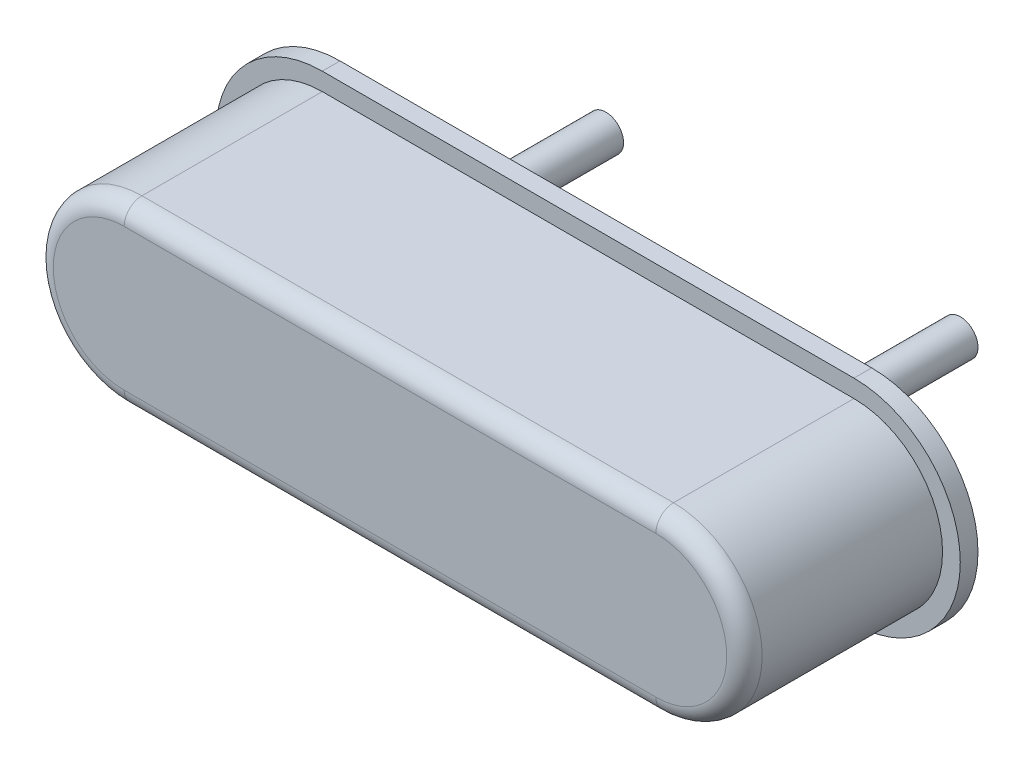
ISO-10303-21;
HEADER;
FILE_DESCRIPTION(('STEP AP214'),'2;1');
FILE_NAME('part.step','',(''),(''),'','','');
FILE_SCHEMA(('AUTOMOTIVE_DESIGN { 1 0 10303 214 1 1 1 1 }'));
ENDSEC;
DATA;
#1=APPLICATION_CONTEXT('core data for automotive mechanical design processes');
#2=APPLICATION_PROTOCOL_DEFINITION('international standard','automotive_design',2000,#1);
#3=PRODUCT_CONTEXT('',#1,'mechanical');
#4=PRODUCT('Part','Part','',(#3));
#5=PRODUCT_RELATED_PRODUCT_CATEGORY('part','',(#4));
#6=PRODUCT_DEFINITION_FORMATION('','',#4);
#7=PRODUCT_DEFINITION_CONTEXT('part definition',#1,'design');
#8=PRODUCT_DEFINITION('design','',#6,#7);
#9=PRODUCT_DEFINITION_SHAPE('','',#8);
#10=(LENGTH_UNIT() NAMED_UNIT(*) SI_UNIT(.MILLI.,.METRE.));
#11=(NAMED_UNIT(*) PLANE_ANGLE_UNIT() SI_UNIT($,.RADIAN.));
#12=(NAMED_UNIT(*) SI_UNIT($,.STERADIAN.) SOLID_ANGLE_UNIT());
#13=UNCERTAINTY_MEASURE_WITH_UNIT(LENGTH_MEASURE(1.E-05),#10,'distance_accuracy_value','');
#14=(GEOMETRIC_REPRESENTATION_CONTEXT(3) GLOBAL_UNCERTAINTY_ASSIGNED_CONTEXT((#13)) GLOBAL_UNIT_ASSIGNED_CONTEXT((#10,
#11,#12)) REPRESENTATION_CONTEXT('',''));
#15=CARTESIAN_POINT('',(0.,0.,0.));
#16=DIRECTION('',(0.,0.,1.));
#17=DIRECTION('',(1.,0.,0.));
#18=AXIS2_PLACEMENT_3D('',#15,#16,#17);
#19=CARTESIAN_POINT('',(7.62,1.27,3.09361477877701));
#20=DIRECTION('',(0.,0.,1.));
#21=DIRECTION('',(1.,0.,0.));
#22=AXIS2_PLACEMENT_3D('',#19,#20,#21);
#23=PLANE('',#22);
#24=CARTESIAN_POINT('',(-2.286,0.,3.09361477877701));
#25=CARTESIAN_POINT('',(-2.28600006970439,0.0110828429614261,3.09361477877701));
#26=CARTESIAN_POINT('',(-2.28581865993532,0.0221656819705109,3.09361477877701));
#27=CARTESIAN_POINT('',(-2.28509338181666,0.044319494323339,3.09361477877701));
#28=CARTESIAN_POINT('',(-2.28454951346707,0.0553904676670825,3.09361477877701));
#29=CARTESIAN_POINT('',(-2.28309981855377,0.0775086909285694,3.09361477877701));
#30=CARTESIAN_POINT('',(-2.28219399199005,0.0885559408463128,3.09361477877701));
#31=CARTESIAN_POINT('',(-2.28002137260785,0.110614888303356,3.09361477877701));
#32=CARTESIAN_POINT('',(-2.27875457978936,0.121626585842655,3.09361477877701));
#33=CARTESIAN_POINT('',(-2.27586137852222,0.143602636748491,3.09361477877701));
#34=CARTESIAN_POINT('',(-2.27423497007356,0.154566990115027,3.09361477877701));
#35=CARTESIAN_POINT('',(-2.27062428072291,0.176436611822779,3.09361477877701));
#36=CARTESIAN_POINT('',(-2.26863999982091,0.187341880163995,3.09361477877701));
#37=CARTESIAN_POINT('',(-2.26431568995845,0.20908165417278,3.09361477877701));
#38=CARTESIAN_POINT('',(-2.261975660998,0.219916159840348,3.09361477877701));
#39=CARTESIAN_POINT('',(-2.25694236089354,0.241502806645501,3.09361477877701));
#40=CARTESIAN_POINT('',(-2.25424908974954,0.252254947783086,3.09361477877701));
#41=CARTESIAN_POINT('',(-2.24851218926984,0.273665351865239,3.09361477877701));
#42=CARTESIAN_POINT('',(-2.24546855993414,0.284323614809807,3.09361477877701));
#43=CARTESIAN_POINT('',(-2.2390342022737,0.305534849371265,3.09361477877701));
#44=CARTESIAN_POINT('',(-2.23564347394896,0.316087820988155,3.09361477877701));
#45=CARTESIAN_POINT('',(-2.22851854918509,0.337077172507873,3.09361477877701));
#46=CARTESIAN_POINT('',(-2.22478435274596,0.347513552410702,3.09361477877701));
#47=CARTESIAN_POINT('',(-2.21697649042492,0.368258544965249,3.09361477877701));
#48=CARTESIAN_POINT('',(-2.21290282454301,0.378567157616967,3.09361477877701));
#49=CARTESIAN_POINT('',(-2.20442038551993,0.399045576948899,3.09361477877701));
#50=CARTESIAN_POINT('',(-2.20001161237876,0.409215383629113,3.09361477877701));
#51=CARTESIAN_POINT('',(-2.19086367986107,0.429405300933422,3.09361477877701));
#52=CARTESIAN_POINT('',(-2.18612452048455,0.439425411557518,3.09361477877701));
#53=CARTESIAN_POINT('',(-2.17632089030987,0.459305206967497,3.09361477877701));
#54=CARTESIAN_POINT('',(-2.17125641951171,0.46916489175338,3.09361477877701));
#55=CARTESIAN_POINT('',(-2.16080758964415,0.488713277477052,3.09361477877701));
#56=CARTESIAN_POINT('',(-2.15542323057476,0.498401978414841,3.09361477877701));
#57=CARTESIAN_POINT('',(-2.14434038991522,0.517598021585164,3.09361477877701));
#58=CARTESIAN_POINT('',(-2.13864190832507,0.527105363817697,3.09361477877701));
#59=CARTESIAN_POINT('',(-2.12693692453694,0.545928508703856,3.09361477877701));
#60=CARTESIAN_POINT('',(-2.12093042233896,0.555244311357483,3.09361477877701));
#61=CARTESIAN_POINT('',(-2.10861582985981,0.573674402138354,3.09361477877702));
#62=CARTESIAN_POINT('',(-2.10230773957865,0.582788690265599,3.09361477877702));
#63=CARTESIAN_POINT('',(-2.08939672351151,0.600805989769781,3.093614778777));
#64=CARTESIAN_POINT('',(-2.08279379772553,0.609709001146719,3.09361477877698));
#65=CARTESIAN_POINT('',(-2.06930018974625,0.627294222599008,3.09361477877705));
#66=CARTESIAN_POINT('',(-2.06240950755295,0.63597643267436,3.09361477877715));
#67=CARTESIAN_POINT('',(-2.04834773368012,0.653110720746174,3.09361477877687));
#68=CARTESIAN_POINT('',(-2.04117664200059,0.661562798742637,3.09361477877649));
#69=CARTESIAN_POINT('',(-2.02656184679669,0.678227897540709,3.09361477877754));
#70=CARTESIAN_POINT('',(-2.01911814327232,0.686440918342317,3.09361477877897));
#71=CARTESIAN_POINT('',(-2.00396565244968,0.702618639368164,3.09361477877506));
#72=CARTESIAN_POINT('',(-1.99625686515141,0.710583339592402,3.09361477876972));
#73=CARTESIAN_POINT('',(-1.98025023864782,0.726591548354166,3.09361477878462));
#74=CARTESIAN_POINT('',(-1.97194129582777,0.734623956587176,3.09361477880594));
#75=CARTESIAN_POINT('',(-1.95505728685366,0.750404098812195,3.09361477860269));
#76=CARTESIAN_POINT('',(-1.94648221905385,0.758151831043098,3.0936147783781));
#77=CARTESIAN_POINT('',(-1.92907511237835,0.773353373380228,3.09361477684965));
#78=CARTESIAN_POINT('',(-1.92024306881059,0.780807178113833,3.09361477554577));
#79=CARTESIAN_POINT('',(-1.90233220758002,0.795412735095192,3.09361477023151));
#80=CARTESIAN_POINT('',(-1.89325338243466,0.80256447816743,3.09361476622106));
#81=CARTESIAN_POINT('',(-1.87485873935727,0.81655718244829,3.09361475411262));
#82=CARTESIAN_POINT('',(-1.86554291138422,0.823398130455225,3.09361474601445));
#83=CARTESIAN_POINT('',(-1.84668629790388,0.836763793488626,3.09361472066954));
#84=CARTESIAN_POINT('',(-1.83714550015984,0.84328849125409,3.09361470342229));
#85=CARTESIAN_POINT('',(-1.81788991333722,0.855975456813122,3.09361466579362));
#86=CARTESIAN_POINT('',(-1.80817615173484,0.862139282709894,3.0936146454273));
#87=CARTESIAN_POINT('',(-1.7885375158274,0.874121321419225,3.0936146183302));
#88=CARTESIAN_POINT('',(-1.77861263799295,0.879939528447626,3.09361461159967));
#89=CARTESIAN_POINT('',(-1.75856592567626,0.891225734078276,3.0936146120321));
#90=CARTESIAN_POINT('',(-1.74844409472762,0.896693738956084,3.09361461919482));
#91=CARTESIAN_POINT('',(-1.72801523750907,0.907270425506461,3.09361464505805));
#92=CARTESIAN_POINT('',(-1.71770822100459,0.912379126056877,3.09361466375796));
#93=CARTESIAN_POINT('',(-1.69692435935762,0.922237036220719,3.09361470616119));
#94=CARTESIAN_POINT('',(-1.68644752910871,0.926986277155764,3.09361472986407));
#95=CARTESIAN_POINT('',(-1.66532884458496,0.936096685004547,3.0936147638598));
#96=CARTESIAN_POINT('',(-1.65468701058188,0.940457899153098,3.09361477415428));
#97=CARTESIAN_POINT('',(-1.62902498169139,0.950545042520134,3.09361478523819));
#98=CARTESIAN_POINT('',(-1.61394666605452,0.95612393414505,3.09361478061929));
#99=CARTESIAN_POINT('',(-1.58356608154031,0.96654672045632,3.09361477685));
#100=CARTESIAN_POINT('',(-1.56826424694012,0.971391874421192,3.09361477769014));
#101=CARTESIAN_POINT('',(-1.54051417396411,0.979464921066938,3.09361477381276));
#102=CARTESIAN_POINT('',(-1.52810352330763,0.982822825179837,3.09361477016712));
#103=CARTESIAN_POINT('',(-1.50535154934959,0.988513975809947,3.09361476317229));
#104=CARTESIAN_POINT('',(-1.49502933837281,0.990923623554545,3.09361475988337));
#105=CARTESIAN_POINT('',(-1.47651939238868,0.994936818450563,3.0936147549314));
#106=CARTESIAN_POINT('',(-1.46834511740556,0.996602761674991,3.09361475307128));
#107=CARTESIAN_POINT('',(-1.4497129019225,1.0001579279832,3.09361475049164));
#108=CARTESIAN_POINT('',(-1.43924270830215,1.00198332670068,3.09361475022408));
#109=CARTESIAN_POINT('',(-1.41825004014712,1.00530238717345,3.09361475085014));
#110=CARTESIAN_POINT('',(-1.40772756583245,1.00679605032349,3.09361475174377));
#111=CARTESIAN_POINT('',(-1.38664069505585,1.00944940891939,3.09361475483023));
#112=CARTESIAN_POINT('',(-1.3760762991394,1.01060910869637,3.09361475702305));
#113=CARTESIAN_POINT('',(-1.35491633918655,1.01259357636841,3.09361476208027));
#114=CARTESIAN_POINT('',(-1.34432077583256,1.01341835154253,3.09361476494465));
#115=CARTESIAN_POINT('',(-1.32310917203112,1.01473208175593,3.09361477053998));
#116=CARTESIAN_POINT('',(-1.31249313221809,1.015221047037,3.09361477327094));
#117=CARTESIAN_POINT('',(-1.29125131355773,1.01586276504996,3.09361477736166));
#118=CARTESIAN_POINT('',(-1.28062553510918,1.01601553098294,3.09361477872149));
#119=CARTESIAN_POINT('',(-1.27,1.016,3.09361477877701));
#120=B_SPLINE_CURVE_WITH_KNOTS('',3,(#24,#25,#26,#27,#28,#29,#30,#31,#32,#33,#34,#35,#36,#37,
#38,#39,#40,#41,#42,#43,#44,#45,#46,#47,#48,#49,#50,#51,#52,#53,#54,#55,#56,#57,#58,#59,#60,#61,
#62,#63,#64,#65,#66,#67,#68,#69,#70,#71,#72,#73,#74,#75,#76,#77,#78,#79,#80,#81,#82,#83,#84,#85,
#86,#87,#88,#89,#90,#91,#92,#93,#94,#95,#96,#97,#98,#99,#100,#101,#102,#103,#104,#105,#106,#107,
#108,#109,#110,#111,#112,#113,#114,#115,#116,#117,#118,#119),.UNSPECIFIED.,.F.,.F.,(4,2,2,2,2,2,
2,2,2,2,2,2,2,2,2,2,2,2,2,2,2,2,2,2,2,2,2,2,2,2,2,2,2,2,2,2,2,2,2,2,2,2,2,2,2,2,2,4),(0.,
0.0332470386650213,0.0664940773300427,0.099741115995064,0.132988154660085,0.166235193325106,
0.199482231990128,0.232729270655149,0.26597630932017,0.299223347985192,0.332470386650213,
0.365717425315235,0.398964463980256,0.432211502645277,0.465458541310299,0.49870557997532,
0.531952618640341,0.565199657305363,0.598446695970384,0.631693734635406,0.664940773300427,
0.698187811965448,0.73143485063047,0.764681889295491,0.797928927960512,0.832592485537155,
0.867256257518567,0.901920662816368,0.936586120334273,0.971253048967738,1.00592186760356,
1.04042787946357,1.07493446864175,1.10944043929505,1.14394459564845,1.17844574200259,
1.2129426827418,1.26115892690837,1.30929145845021,1.34785327467885,1.37964701779794,
1.40467157499548,1.43655034545945,1.46842898188856,1.50030720486883,1.53218473498877,
1.56406129283952,1.59593659901497),.UNSPECIFIED.);
#121=CARTESIAN_POINT('',(-2.286,0.,3.09361477877701));
#122=VERTEX_POINT('',#121);
#123=CARTESIAN_POINT('',(-1.27,1.016,3.09361477877701));
#124=VERTEX_POINT('',#123);
#125=EDGE_CURVE('E89',#122,#124,#120,.T.);
#126=ORIENTED_EDGE('',*,*,#125,.F.);
#127=CARTESIAN_POINT('',(-1.27,0.,3.09361477877701));
#128=DIRECTION('',(0.,0.,1.));
#129=DIRECTION('',(1.,0.,0.));
#130=AXIS2_PLACEMENT_3D('',#127,#128,#129);
#131=CIRCLE('',#130,1.016);
#132=CARTESIAN_POINT('',(-1.27,-1.016,3.09361477877701));
#133=VERTEX_POINT('',#132);
#134=EDGE_CURVE('E20',#133,#122,#131,.F.);
#135=ORIENTED_EDGE('',*,*,#134,.F.);
#136=DIRECTION('',(1.,0.,0.));
#137=VECTOR('',#136,1.);
#138=CARTESIAN_POINT('',(-2.54,-1.016,3.09361477877701));
#139=LINE('',#138,#137);
#140=CARTESIAN_POINT('',(6.35,-1.016,3.09361477877701));
#141=VERTEX_POINT('',#140);
#142=EDGE_CURVE('E95',#141,#133,#139,.F.);
#143=ORIENTED_EDGE('',*,*,#142,.F.);
#144=CARTESIAN_POINT('',(6.35,0.,3.09361477877701));
#145=DIRECTION('',(0.,0.,1.));
#146=DIRECTION('',(1.,0.,0.));
#147=AXIS2_PLACEMENT_3D('',#144,#145,#146);
#148=CIRCLE('',#147,1.016);
#149=CARTESIAN_POINT('',(6.35,1.016,3.09361477877701));
#150=VERTEX_POINT('',#149);
#151=EDGE_CURVE('E230',#150,#141,#148,.F.);
#152=ORIENTED_EDGE('',*,*,#151,.F.);
#153=DIRECTION('',(-1.,0.,0.));
#154=VECTOR('',#153,1.);
#155=CARTESIAN_POINT('',(7.62,1.016,3.09361477877701));
#156=LINE('',#155,#154);
#157=EDGE_CURVE('E91',#124,#150,#156,.F.);
#158=ORIENTED_EDGE('',*,*,#157,.F.);
#159=EDGE_LOOP('',(#126,#135,#143,#152,#158));
#160=FACE_BOUND('',#159,.T.);
#161=ADVANCED_FACE('F16',(#160),#23,.T.);
#162=CARTESIAN_POINT('',(-1.27,0.,2.83961477877701));
#163=DIRECTION('',(0.,0.,1.));
#164=DIRECTION('',(1.,0.,0.));
#165=AXIS2_PLACEMENT_3D('',#162,#163,#164);
#166=TOROIDAL_SURFACE('',#165,1.016,0.254);
#167=ORIENTED_EDGE('',*,*,#134,.T.);
#168=ORIENTED_EDGE('',*,*,#125,.T.);
#169=CARTESIAN_POINT('',(-1.27,1.016,2.83961477877701));
#170=DIRECTION('',(-1.,0.,0.));
#171=DIRECTION('',(0.,0.,1.));
#172=AXIS2_PLACEMENT_3D('',#169,#170,#171);
#173=CIRCLE('',#172,0.254);
#174=CARTESIAN_POINT('',(-1.27,1.27,2.83961477877701));
#175=VERTEX_POINT('',#174);
#176=EDGE_CURVE('E231',#175,#124,#173,.F.);
#177=ORIENTED_EDGE('',*,*,#176,.F.);
#178=CARTESIAN_POINT('',(-1.27,0.,2.83961477877701));
#179=DIRECTION('',(0.,0.,-1.));
#180=DIRECTION('',(-1.,0.,0.));
#181=AXIS2_PLACEMENT_3D('',#178,#179,#180);
#182=CIRCLE('',#181,1.27);
#183=CARTESIAN_POINT('',(-1.27,-1.27,2.83961477877701));
#184=VERTEX_POINT('',#183);
#185=EDGE_CURVE('E103',#184,#175,#182,.T.);
#186=ORIENTED_EDGE('',*,*,#185,.F.);
#187=CARTESIAN_POINT('',(-1.27,-1.016,2.83961477877701));
#188=DIRECTION('',(1.,0.,0.));
#189=DIRECTION('',(0.,0.,-1.));
#190=AXIS2_PLACEMENT_3D('',#187,#188,#189);
#191=CIRCLE('',#190,0.254);
#192=EDGE_CURVE('E100',#133,#184,#191,.T.);
#193=ORIENTED_EDGE('',*,*,#192,.F.);
#194=EDGE_LOOP('',(#167,#168,#177,#186,#193));
#195=FACE_BOUND('',#194,.T.);
#196=ADVANCED_FACE('F97',(#195),#166,.T.);
#197=CARTESIAN_POINT('',(-2.54,-1.016,2.83961477877701));
#198=DIRECTION('',(1.,0.,0.));
#199=DIRECTION('',(0.,0.,-1.));
#200=AXIS2_PLACEMENT_3D('',#197,#198,#199);
#201=CYLINDRICAL_SURFACE('',#200,0.254);
#202=ORIENTED_EDGE('',*,*,#192,.T.);
#203=DIRECTION('',(1.,0.,0.));
#204=VECTOR('',#203,1.);
#205=CARTESIAN_POINT('',(-2.54,-1.27,2.83961477877701));
#206=LINE('',#205,#204);
#207=CARTESIAN_POINT('',(6.35,-1.27,2.83961477877701));
#208=VERTEX_POINT('',#207);
#209=EDGE_CURVE('E252',#184,#208,#206,.T.);
#210=ORIENTED_EDGE('',*,*,#209,.T.);
#211=CARTESIAN_POINT('',(6.35,-1.016,2.83961477877701));
#212=DIRECTION('',(1.,0.,0.));
#213=DIRECTION('',(0.,0.,-1.));
#214=AXIS2_PLACEMENT_3D('',#211,#212,#213);
#215=CIRCLE('',#214,0.254);
#216=EDGE_CURVE('E108',#141,#208,#215,.T.);
#217=ORIENTED_EDGE('',*,*,#216,.F.);
#218=ORIENTED_EDGE('',*,*,#142,.T.);
#219=EDGE_LOOP('',(#202,#210,#217,#218));
#220=FACE_BOUND('',#219,.T.);
#221=ADVANCED_FACE('F111',(#220),#201,.T.);
#222=CARTESIAN_POINT('',(6.35,0.,2.83961477877701));
#223=DIRECTION('',(0.,0.,1.));
#224=DIRECTION('',(1.,0.,0.));
#225=AXIS2_PLACEMENT_3D('',#222,#223,#224);
#226=TOROIDAL_SURFACE('',#225,1.016,0.253999999999999);
#227=CARTESIAN_POINT('',(6.35,0.,2.83961477877701));
#228=DIRECTION('',(0.,0.,1.));
#229=DIRECTION('',(1.,0.,0.));
#230=AXIS2_PLACEMENT_3D('',#227,#228,#229);
#231=CIRCLE('',#230,1.27);
#232=CARTESIAN_POINT('',(6.35,1.27,2.83961477877701));
#233=VERTEX_POINT('',#232);
#234=EDGE_CURVE('E267',#233,#208,#231,.F.);
#235=ORIENTED_EDGE('',*,*,#234,.F.);
#236=CARTESIAN_POINT('',(6.35,1.016,2.83961477877701));
#237=DIRECTION('',(-1.,0.,0.));
#238=DIRECTION('',(0.,0.,1.));
#239=AXIS2_PLACEMENT_3D('',#236,#237,#238);
#240=CIRCLE('',#239,0.254);
#241=EDGE_CURVE('E248',#150,#233,#240,.T.);
#242=ORIENTED_EDGE('',*,*,#241,.F.);
#243=ORIENTED_EDGE('',*,*,#151,.T.);
#244=ORIENTED_EDGE('',*,*,#216,.T.);
#245=EDGE_LOOP('',(#235,#242,#243,#244));
#246=FACE_BOUND('',#245,.T.);
#247=ADVANCED_FACE('F18',(#246),#226,.T.);
#248=CARTESIAN_POINT('',(7.62,1.016,2.83961477877701));
#249=DIRECTION('',(-1.,0.,0.));
#250=DIRECTION('',(0.,0.,1.));
#251=AXIS2_PLACEMENT_3D('',#248,#249,#250);
#252=CYLINDRICAL_SURFACE('',#251,0.254);
#253=ORIENTED_EDGE('',*,*,#241,.T.);
#254=DIRECTION('',(1.,0.,0.));
#255=VECTOR('',#254,1.);
#256=CARTESIAN_POINT('',(-2.54,1.27,2.83961477877701));
#257=LINE('',#256,#255);
#258=EDGE_CURVE('E281',#175,#233,#257,.T.);
#259=ORIENTED_EDGE('',*,*,#258,.F.);
#260=ORIENTED_EDGE('',*,*,#176,.T.);
#261=ORIENTED_EDGE('',*,*,#157,.T.);
#262=EDGE_LOOP('',(#253,#259,#260,#261));
#263=FACE_BOUND('',#262,.T.);
#264=ADVANCED_FACE('F130',(#263),#252,.T.);
#265=CARTESIAN_POINT('',(-1.27,0.,0.));
#266=DIRECTION('',(0.,0.,-1.));
#267=DIRECTION('',(-1.,0.,0.));
#268=AXIS2_PLACEMENT_3D('',#265,#266,#267);
#269=CYLINDRICAL_SURFACE('',#268,1.27);
#270=CARTESIAN_POINT('',(-1.27,0.,0.254));
#271=DIRECTION('',(0.,0.,-1.));
#272=DIRECTION('',(-1.,0.,0.));
#273=AXIS2_PLACEMENT_3D('',#270,#271,#272);
#274=CIRCLE('',#273,1.27);
#275=CARTESIAN_POINT('',(-1.27,1.27,0.254));
#276=VERTEX_POINT('',#275);
#277=CARTESIAN_POINT('',(-1.27,-1.27,0.254));
#278=VERTEX_POINT('',#277);
#279=EDGE_CURVE('E228',#276,#278,#274,.F.);
#280=ORIENTED_EDGE('',*,*,#279,.T.);
#281=DIRECTION('',(0.,0.,1.));
#282=VECTOR('',#281,1.);
#283=CARTESIAN_POINT('',(-1.27,-1.27,0.));
#284=LINE('',#283,#282);
#285=EDGE_CURVE('E247',#278,#184,#284,.T.);
#286=ORIENTED_EDGE('',*,*,#285,.T.);
#287=ORIENTED_EDGE('',*,*,#185,.T.);
#288=DIRECTION('',(0.,0.,1.));
#289=VECTOR('',#288,1.);
#290=CARTESIAN_POINT('',(-1.27,1.27,0.));
#291=LINE('',#290,#289);
#292=EDGE_CURVE('E270',#276,#175,#291,.T.);
#293=ORIENTED_EDGE('',*,*,#292,.F.);
#294=EDGE_LOOP('',(#280,#286,#287,#293));
#295=FACE_BOUND('',#294,.T.);
#296=ADVANCED_FACE('F133',(#295),#269,.T.);
#297=CARTESIAN_POINT('',(-2.54,-1.27,0.));
#298=DIRECTION('',(0.,1.,0.));
#299=DIRECTION('',(0.,0.,1.));
#300=AXIS2_PLACEMENT_3D('',#297,#298,#299);
#301=PLANE('',#300);
#302=ORIENTED_EDGE('',*,*,#209,.F.);
#303=ORIENTED_EDGE('',*,*,#285,.F.);
#304=DIRECTION('',(-1.,0.,0.));
#305=VECTOR('',#304,1.);
#306=CARTESIAN_POINT('',(6.35,-1.27,0.254));
#307=LINE('',#306,#305);
#308=CARTESIAN_POINT('',(6.35,-1.27,0.254));
#309=VERTEX_POINT('',#308);
#310=EDGE_CURVE('E227',#278,#309,#307,.F.);
#311=ORIENTED_EDGE('',*,*,#310,.T.);
#312=DIRECTION('',(0.,0.,1.));
#313=VECTOR('',#312,1.);
#314=CARTESIAN_POINT('',(6.35,-1.27,0.));
#315=LINE('',#314,#313);
#316=EDGE_CURVE('E265',#208,#309,#315,.F.);
#317=ORIENTED_EDGE('',*,*,#316,.F.);
#318=EDGE_LOOP('',(#302,#303,#311,#317));
#319=FACE_BOUND('',#318,.T.);
#320=ADVANCED_FACE('F137',(#319),#301,.F.);
#321=CARTESIAN_POINT('',(6.35,0.,0.));
#322=DIRECTION('',(0.,0.,1.));
#323=DIRECTION('',(1.,0.,0.));
#324=AXIS2_PLACEMENT_3D('',#321,#322,#323);
#325=CYLINDRICAL_SURFACE('',#324,1.27);
#326=DIRECTION('',(0.,0.,1.));
#327=VECTOR('',#326,1.);
#328=CARTESIAN_POINT('',(6.35,1.27,0.));
#329=LINE('',#328,#327);
#330=CARTESIAN_POINT('',(6.35,1.27,0.254));
#331=VERTEX_POINT('',#330);
#332=EDGE_CURVE('E229',#233,#331,#329,.F.);
#333=ORIENTED_EDGE('',*,*,#332,.F.);
#334=ORIENTED_EDGE('',*,*,#234,.T.);
#335=ORIENTED_EDGE('',*,*,#316,.T.);
#336=CARTESIAN_POINT('',(6.35,0.,0.254));
#337=DIRECTION('',(0.,0.,1.));
#338=DIRECTION('',(1.,0.,0.));
#339=AXIS2_PLACEMENT_3D('',#336,#337,#338);
#340=CIRCLE('',#339,1.27);
#341=EDGE_CURVE('E225',#309,#331,#340,.T.);
#342=ORIENTED_EDGE('',*,*,#341,.T.);
#343=EDGE_LOOP('',(#333,#334,#335,#342));
#344=FACE_BOUND('',#343,.T.);
#345=ADVANCED_FACE('F141',(#344),#325,.T.);
#346=CARTESIAN_POINT('',(-2.54,1.27,0.));
#347=DIRECTION('',(0.,1.,0.));
#348=DIRECTION('',(0.,0.,1.));
#349=AXIS2_PLACEMENT_3D('',#346,#347,#348);
#350=PLANE('',#349);
#351=ORIENTED_EDGE('',*,*,#332,.T.);
#352=DIRECTION('',(-1.,0.,0.));
#353=VECTOR('',#352,1.);
#354=CARTESIAN_POINT('',(6.35,1.27,0.254));
#355=LINE('',#354,#353);
#356=EDGE_CURVE('E224',#331,#276,#355,.T.);
#357=ORIENTED_EDGE('',*,*,#356,.T.);
#358=ORIENTED_EDGE('',*,*,#292,.T.);
#359=ORIENTED_EDGE('',*,*,#258,.T.);
#360=EDGE_LOOP('',(#351,#357,#358,#359));
#361=FACE_BOUND('',#360,.T.);
#362=ADVANCED_FACE('F145',(#361),#350,.T.);
#363=CARTESIAN_POINT('',(6.35,0.,0.254));
#364=DIRECTION('',(0.,0.,-1.));
#365=DIRECTION('',(-1.,0.,0.));
#366=AXIS2_PLACEMENT_3D('',#363,#364,#365);
#367=PLANE('',#366);
#368=ORIENTED_EDGE('',*,*,#341,.F.);
#369=ORIENTED_EDGE('',*,*,#310,.F.);
#370=ORIENTED_EDGE('',*,*,#279,.F.);
#371=ORIENTED_EDGE('',*,*,#356,.F.);
#372=EDGE_LOOP('',(#368,#369,#370,#371));
#373=FACE_BOUND('',#372,.T.);
#374=CARTESIAN_POINT('',(-1.27,0.,0.254));
#375=DIRECTION('',(0.,0.,-1.));
#376=DIRECTION('',(-1.,0.,0.));
#377=AXIS2_PLACEMENT_3D('',#374,#375,#376);
#378=CIRCLE('',#377,1.524);
#379=CARTESIAN_POINT('',(-1.27,-1.524,0.254));
#380=VERTEX_POINT('',#379);
#381=CARTESIAN_POINT('',(-1.27,1.524,0.254));
#382=VERTEX_POINT('',#381);
#383=EDGE_CURVE('E220',#380,#382,#378,.T.);
#384=ORIENTED_EDGE('',*,*,#383,.F.);
#385=DIRECTION('',(1.,0.,0.));
#386=VECTOR('',#385,1.);
#387=CARTESIAN_POINT('',(6.35,-1.524,0.254));
#388=LINE('',#387,#386);
#389=CARTESIAN_POINT('',(6.35,-1.524,0.254));
#390=VERTEX_POINT('',#389);
#391=EDGE_CURVE('E295',#390,#380,#388,.F.);
#392=ORIENTED_EDGE('',*,*,#391,.F.);
#393=CARTESIAN_POINT('',(6.35,0.,0.254));
#394=DIRECTION('',(0.,0.,-1.));
#395=DIRECTION('',(-1.,0.,0.));
#396=AXIS2_PLACEMENT_3D('',#393,#394,#395);
#397=CIRCLE('',#396,1.524);
#398=CARTESIAN_POINT('',(6.35,1.524,0.254));
#399=VERTEX_POINT('',#398);
#400=EDGE_CURVE('E216',#399,#390,#397,.T.);
#401=ORIENTED_EDGE('',*,*,#400,.F.);
#402=DIRECTION('',(1.,0.,0.));
#403=VECTOR('',#402,1.);
#404=CARTESIAN_POINT('',(-1.27,1.524,0.254));
#405=LINE('',#404,#403);
#406=EDGE_CURVE('E223',#382,#399,#405,.T.);
#407=ORIENTED_EDGE('',*,*,#406,.F.);
#408=EDGE_LOOP('',(#384,#392,#401,#407));
#409=FACE_BOUND('',#408,.T.);
#410=ADVANCED_FACE('F149',(#373,#409),#367,.F.);
#411=CARTESIAN_POINT('',(5.08,0.,-2.54));
#412=DIRECTION('',(0.,0.,1.));
#413=DIRECTION('',(1.,0.,0.));
#414=AXIS2_PLACEMENT_3D('',#411,#412,#413);
#415=PLANE('',#414);
#416=CARTESIAN_POINT('',(5.08,0.,-2.54));
#417=DIRECTION('',(0.,0.,-1.));
#418=DIRECTION('',(-1.,0.,0.));
#419=AXIS2_PLACEMENT_3D('',#416,#417,#418);
#420=CIRCLE('',#419,0.254);
#421=CARTESIAN_POINT('',(4.826,0.,-2.54));
#422=VERTEX_POINT('',#421);
#423=EDGE_CURVE('E213',#422,#422,#420,.F.);
#424=ORIENTED_EDGE('',*,*,#423,.F.);
#425=EDGE_LOOP('',(#424));
#426=FACE_BOUND('',#425,.T.);
#427=ADVANCED_FACE('F153',(#426),#415,.F.);
#428=CARTESIAN_POINT('',(0.,0.,-2.54));
#429=DIRECTION('',(0.,0.,1.));
#430=DIRECTION('',(1.,0.,0.));
#431=AXIS2_PLACEMENT_3D('',#428,#429,#430);
#432=PLANE('',#431);
#433=CARTESIAN_POINT('',(0.,0.,-2.54));
#434=DIRECTION('',(0.,0.,-1.));
#435=DIRECTION('',(-1.,0.,0.));
#436=AXIS2_PLACEMENT_3D('',#433,#434,#435);
#437=CIRCLE('',#436,0.254);
#438=CARTESIAN_POINT('',(-0.254,0.,-2.54));
#439=VERTEX_POINT('',#438);
#440=EDGE_CURVE('E210',#439,#439,#437,.F.);
#441=ORIENTED_EDGE('',*,*,#440,.F.);
#442=EDGE_LOOP('',(#441));
#443=FACE_BOUND('',#442,.T.);
#444=ADVANCED_FACE('F157',(#443),#432,.F.);
#445=CARTESIAN_POINT('',(-1.27,0.,0.254));
#446=DIRECTION('',(0.,0.,-1.));
#447=DIRECTION('',(-1.,0.,0.));
#448=AXIS2_PLACEMENT_3D('',#445,#446,#447);
#449=CYLINDRICAL_SURFACE('',#448,1.524);
#450=DIRECTION('',(0.,0.,1.));
#451=VECTOR('',#450,1.);
#452=CARTESIAN_POINT('',(-1.27,1.524,0.254));
#453=LINE('',#452,#451);
#454=CARTESIAN_POINT('',(-1.27,1.524,0.));
#455=VERTEX_POINT('',#454);
#456=EDGE_CURVE('E219',#455,#382,#453,.T.);
#457=ORIENTED_EDGE('',*,*,#456,.F.);
#458=CARTESIAN_POINT('',(-1.27,0.,0.));
#459=DIRECTION('',(0.,0.,-1.));
#460=DIRECTION('',(-1.,0.,0.));
#461=AXIS2_PLACEMENT_3D('',#458,#459,#460);
#462=CIRCLE('',#461,1.524);
#463=CARTESIAN_POINT('',(-1.27,-1.524,0.));
#464=VERTEX_POINT('',#463);
#465=EDGE_CURVE('E206',#464,#455,#462,.T.);
#466=ORIENTED_EDGE('',*,*,#465,.F.);
#467=DIRECTION('',(0.,0.,-1.));
#468=VECTOR('',#467,1.);
#469=CARTESIAN_POINT('',(-1.27,-1.524,0.254));
#470=LINE('',#469,#468);
#471=EDGE_CURVE('E298',#380,#464,#470,.T.);
#472=ORIENTED_EDGE('',*,*,#471,.F.);
#473=ORIENTED_EDGE('',*,*,#383,.T.);
#474=EDGE_LOOP('',(#457,#466,#472,#473));
#475=FACE_BOUND('',#474,.T.);
#476=ADVANCED_FACE('F161',(#475),#449,.T.);
#477=CARTESIAN_POINT('',(-1.27,1.524,0.254));
#478=DIRECTION('',(0.,1.,0.));
#479=DIRECTION('',(0.,0.,1.));
#480=AXIS2_PLACEMENT_3D('',#477,#478,#479);
#481=PLANE('',#480);
#482=DIRECTION('',(-1.,0.,0.));
#483=VECTOR('',#482,1.);
#484=CARTESIAN_POINT('',(-2.54,1.524,0.));
#485=LINE('',#484,#483);
#486=CARTESIAN_POINT('',(6.35,1.524,0.));
#487=VERTEX_POINT('',#486);
#488=EDGE_CURVE('E202',#455,#487,#485,.F.);
#489=ORIENTED_EDGE('',*,*,#488,.F.);
#490=ORIENTED_EDGE('',*,*,#456,.T.);
#491=ORIENTED_EDGE('',*,*,#406,.T.);
#492=DIRECTION('',(0.,0.,-1.));
#493=VECTOR('',#492,1.);
#494=CARTESIAN_POINT('',(6.35,1.524,0.254));
#495=LINE('',#494,#493);
#496=EDGE_CURVE('E218',#487,#399,#495,.F.);
#497=ORIENTED_EDGE('',*,*,#496,.F.);
#498=EDGE_LOOP('',(#489,#490,#491,#497));
#499=FACE_BOUND('',#498,.T.);
#500=ADVANCED_FACE('F165',(#499),#481,.T.);
#501=CARTESIAN_POINT('',(6.35,0.,0.254));
#502=DIRECTION('',(0.,0.,-1.));
#503=DIRECTION('',(-1.,0.,0.));
#504=AXIS2_PLACEMENT_3D('',#501,#502,#503);
#505=CYLINDRICAL_SURFACE('',#504,1.524);
#506=CARTESIAN_POINT('',(6.35,0.,0.));
#507=DIRECTION('',(0.,0.,-1.));
#508=DIRECTION('',(-1.,0.,0.));
#509=AXIS2_PLACEMENT_3D('',#506,#507,#508);
#510=CIRCLE('',#509,1.524);
#511=CARTESIAN_POINT('',(6.35,-1.524,0.));
#512=VERTEX_POINT('',#511);
#513=EDGE_CURVE('E199',#487,#512,#510,.T.);
#514=ORIENTED_EDGE('',*,*,#513,.F.);
#515=ORIENTED_EDGE('',*,*,#496,.T.);
#516=ORIENTED_EDGE('',*,*,#400,.T.);
#517=DIRECTION('',(0.,0.,-1.));
#518=VECTOR('',#517,1.);
#519=CARTESIAN_POINT('',(6.35,-1.524,0.254));
#520=LINE('',#519,#518);
#521=EDGE_CURVE('E35',#512,#390,#520,.F.);
#522=ORIENTED_EDGE('',*,*,#521,.F.);
#523=EDGE_LOOP('',(#514,#515,#516,#522));
#524=FACE_BOUND('',#523,.T.);
#525=ADVANCED_FACE('F169',(#524),#505,.T.);
#526=CARTESIAN_POINT('',(6.35,-1.524,0.254));
#527=DIRECTION('',(0.,-1.,0.));
#528=DIRECTION('',(0.,0.,-1.));
#529=AXIS2_PLACEMENT_3D('',#526,#527,#528);
#530=PLANE('',#529);
#531=DIRECTION('',(-1.,0.,0.));
#532=VECTOR('',#531,1.);
#533=CARTESIAN_POINT('',(-2.54,-1.524,0.));
#534=LINE('',#533,#532);
#535=EDGE_CURVE('E200',#512,#464,#534,.T.);
#536=ORIENTED_EDGE('',*,*,#535,.F.);
#537=ORIENTED_EDGE('',*,*,#521,.T.);
#538=ORIENTED_EDGE('',*,*,#391,.T.);
#539=ORIENTED_EDGE('',*,*,#471,.T.);
#540=EDGE_LOOP('',(#536,#537,#538,#539));
#541=FACE_BOUND('',#540,.T.);
#542=ADVANCED_FACE('F173',(#541),#530,.T.);
#543=CARTESIAN_POINT('',(5.08,0.,0.508));
#544=DIRECTION('',(0.,0.,-1.));
#545=DIRECTION('',(-1.,0.,0.));
#546=AXIS2_PLACEMENT_3D('',#543,#544,#545);
#547=CYLINDRICAL_SURFACE('',#546,0.254);
#548=ORIENTED_EDGE('',*,*,#423,.T.);
#549=EDGE_LOOP('',(#548));
#550=FACE_BOUND('',#549,.T.);
#551=CARTESIAN_POINT('',(5.08,0.,0.));
#552=DIRECTION('',(0.,0.,-1.));
#553=DIRECTION('',(-1.,0.,0.));
#554=AXIS2_PLACEMENT_3D('',#551,#552,#553);
#555=CIRCLE('',#554,0.254);
#556=CARTESIAN_POINT('',(4.826,0.,0.));
#557=VERTEX_POINT('',#556);
#558=EDGE_CURVE('E26',#557,#557,#555,.F.);
#559=ORIENTED_EDGE('',*,*,#558,.F.);
#560=EDGE_LOOP('',(#559));
#561=FACE_BOUND('',#560,.T.);
#562=ADVANCED_FACE('F176',(#550,#561),#547,.T.);
#563=CARTESIAN_POINT('',(0.,0.,0.508));
#564=DIRECTION('',(0.,0.,-1.));
#565=DIRECTION('',(-1.,0.,0.));
#566=AXIS2_PLACEMENT_3D('',#563,#564,#565);
#567=CYLINDRICAL_SURFACE('',#566,0.254);
#568=ORIENTED_EDGE('',*,*,#440,.T.);
#569=EDGE_LOOP('',(#568));
#570=FACE_BOUND('',#569,.T.);
#571=CARTESIAN_POINT('',(0.,0.,0.));
#572=DIRECTION('',(0.,0.,-1.));
#573=DIRECTION('',(-1.,0.,0.));
#574=AXIS2_PLACEMENT_3D('',#571,#572,#573);
#575=CIRCLE('',#574,0.254);
#576=CARTESIAN_POINT('',(-0.254,0.,0.));
#577=VERTEX_POINT('',#576);
#578=EDGE_CURVE('E11',#577,#577,#575,.F.);
#579=ORIENTED_EDGE('',*,*,#578,.F.);
#580=EDGE_LOOP('',(#579));
#581=FACE_BOUND('',#580,.T.);
#582=ADVANCED_FACE('F180',(#570,#581),#567,.T.);
#583=CARTESIAN_POINT('',(-2.54,1.27,0.));
#584=DIRECTION('',(0.,0.,-1.));
#585=DIRECTION('',(-1.,0.,0.));
#586=AXIS2_PLACEMENT_3D('',#583,#584,#585);
#587=PLANE('',#586);
#588=ORIENTED_EDGE('',*,*,#578,.T.);
#589=EDGE_LOOP('',(#588));
#590=FACE_BOUND('',#589,.T.);
#591=ORIENTED_EDGE('',*,*,#558,.T.);
#592=EDGE_LOOP('',(#591));
#593=FACE_BOUND('',#592,.T.);
#594=ORIENTED_EDGE('',*,*,#513,.T.);
#595=ORIENTED_EDGE('',*,*,#535,.T.);
#596=ORIENTED_EDGE('',*,*,#465,.T.);
#597=ORIENTED_EDGE('',*,*,#488,.T.);
#598=EDGE_LOOP('',(#594,#595,#596,#597));
#599=FACE_BOUND('',#598,.T.);
#600=ADVANCED_FACE('F184',(#590,#593,#599),#587,.T.);
#601=CLOSED_SHELL('',(#161,#196,#221,#247,#264,#296,#320,#345,#362,#410,#427,#444,#476,#500,
#525,#542,#562,#582,#600));
#602=MANIFOLD_SOLID_BREP('B1',#601);
#603=ADVANCED_BREP_SHAPE_REPRESENTATION('',(#18,#602),#14);
#604=SHAPE_DEFINITION_REPRESENTATION(#9,#603);
ENDSEC;
END-ISO-10303-21;
